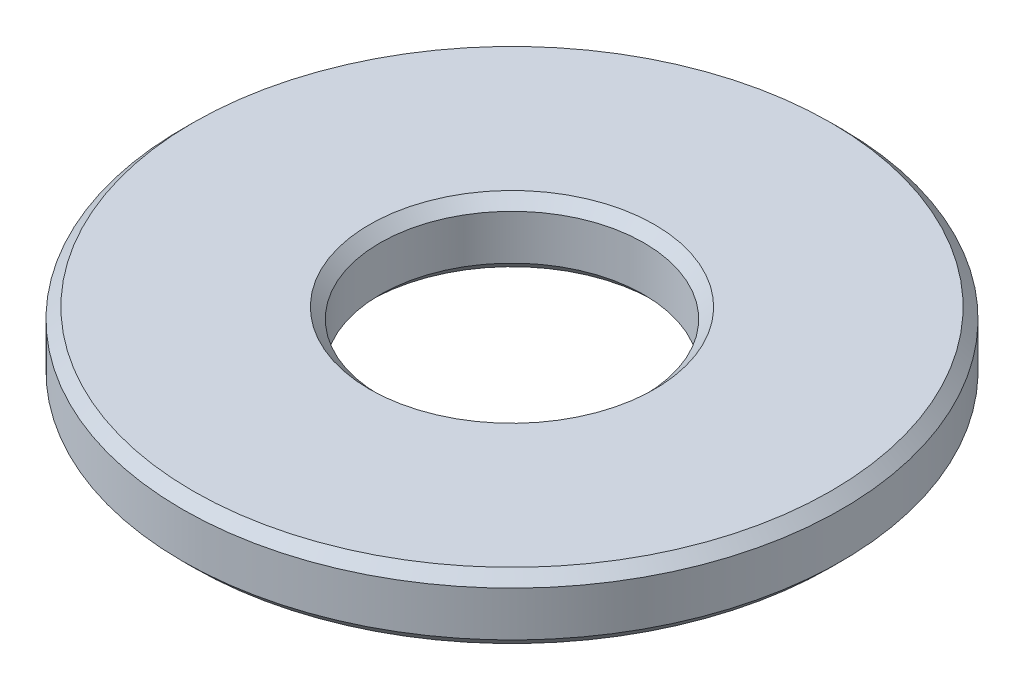
ISO-10303-21;
HEADER;
FILE_DESCRIPTION(('STEP AP214'),'2;1');
FILE_NAME('part.step','',(''),(''),'','','');
FILE_SCHEMA(('AUTOMOTIVE_DESIGN { 1 0 10303 214 1 1 1 1 }'));
ENDSEC;
DATA;
#1=APPLICATION_CONTEXT('core data for automotive mechanical design processes');
#2=APPLICATION_PROTOCOL_DEFINITION('international standard','automotive_design',2000,#1);
#3=PRODUCT_CONTEXT('',#1,'mechanical');
#4=PRODUCT('Part','Part','',(#3));
#5=PRODUCT_RELATED_PRODUCT_CATEGORY('part','',(#4));
#6=PRODUCT_DEFINITION_FORMATION('','',#4);
#7=PRODUCT_DEFINITION_CONTEXT('part definition',#1,'design');
#8=PRODUCT_DEFINITION('design','',#6,#7);
#9=PRODUCT_DEFINITION_SHAPE('','',#8);
#10=(LENGTH_UNIT() NAMED_UNIT(*) SI_UNIT(.MILLI.,.METRE.));
#11=(NAMED_UNIT(*) PLANE_ANGLE_UNIT() SI_UNIT($,.RADIAN.));
#12=(NAMED_UNIT(*) SI_UNIT($,.STERADIAN.) SOLID_ANGLE_UNIT());
#13=UNCERTAINTY_MEASURE_WITH_UNIT(LENGTH_MEASURE(1.E-05),#10,'distance_accuracy_value','');
#14=(GEOMETRIC_REPRESENTATION_CONTEXT(3) GLOBAL_UNCERTAINTY_ASSIGNED_CONTEXT((#13)) GLOBAL_UNIT_ASSIGNED_CONTEXT((#10,
#11,#12)) REPRESENTATION_CONTEXT('',''));
#15=CARTESIAN_POINT('',(0.,0.,0.));
#16=DIRECTION('',(0.,0.,1.));
#17=DIRECTION('',(1.,0.,0.));
#18=AXIS2_PLACEMENT_3D('',#15,#16,#17);
#19=CARTESIAN_POINT('',(3.9624,0.396875,0.));
#20=DIRECTION('',(0.,-1.,0.));
#21=DIRECTION('',(0.,0.,-1.));
#22=AXIS2_PLACEMENT_3D('',#19,#20,#21);
#23=PLANE('',#22);
#24=CARTESIAN_POINT('',(0.,0.396875,0.));
#25=DIRECTION('',(0.,-1.,0.));
#26=DIRECTION('',(0.,0.,-1.));
#27=AXIS2_PLACEMENT_3D('',#24,#25,#26);
#28=CIRCLE('',#27,3.8354);
#29=CARTESIAN_POINT('',(0.,0.396875,-3.8354));
#30=VERTEX_POINT('',#29);
#31=EDGE_CURVE('E41',#30,#30,#28,.F.);
#32=ORIENTED_EDGE('',*,*,#31,.T.);
#33=EDGE_LOOP('',(#32));
#34=FACE_BOUND('',#33,.T.);
#35=CARTESIAN_POINT('',(0.,0.396875,0.));
#36=DIRECTION('',(0.,-1.,0.));
#37=DIRECTION('',(0.,0.,-1.));
#38=AXIS2_PLACEMENT_3D('',#35,#36,#37);
#39=CIRCLE('',#38,1.7145);
#40=CARTESIAN_POINT('',(0.,0.396875,-1.7145));
#41=VERTEX_POINT('',#40);
#42=EDGE_CURVE('E45',#41,#41,#39,.T.);
#43=ORIENTED_EDGE('',*,*,#42,.T.);
#44=EDGE_LOOP('',(#43));
#45=FACE_BOUND('',#44,.T.);
#46=ADVANCED_FACE('F30',(#34,#45),#23,.F.);
#47=CARTESIAN_POINT('',(0.,3.4095890801261,0.));
#48=DIRECTION('',(0.,1.,0.));
#49=DIRECTION('',(0.,0.,1.));
#50=AXIS2_PLACEMENT_3D('',#47,#48,#49);
#51=CYLINDRICAL_SURFACE('',#50,1.5875);
#52=CARTESIAN_POINT('',(0.,0.269875,0.));
#53=DIRECTION('',(0.,-1.,0.));
#54=DIRECTION('',(0.,0.,-1.));
#55=AXIS2_PLACEMENT_3D('',#52,#53,#54);
#56=CIRCLE('',#55,1.5875);
#57=CARTESIAN_POINT('',(0.,0.269875,-1.5875));
#58=VERTEX_POINT('',#57);
#59=EDGE_CURVE('E10',#58,#58,#56,.F.);
#60=ORIENTED_EDGE('',*,*,#59,.T.);
#61=EDGE_LOOP('',(#60));
#62=FACE_BOUND('',#61,.T.);
#63=CARTESIAN_POINT('',(0.,-0.269874999999999,0.));
#64=DIRECTION('',(0.,1.,0.));
#65=DIRECTION('',(0.,0.,1.));
#66=AXIS2_PLACEMENT_3D('',#63,#64,#65);
#67=CIRCLE('',#66,1.5875);
#68=CARTESIAN_POINT('',(0.,-0.269874999999999,1.5875));
#69=VERTEX_POINT('',#68);
#70=EDGE_CURVE('E37',#69,#69,#67,.F.);
#71=ORIENTED_EDGE('',*,*,#70,.T.);
#72=EDGE_LOOP('',(#71));
#73=FACE_BOUND('',#72,.T.);
#74=ADVANCED_FACE('F75',(#62,#73),#51,.F.);
#75=CARTESIAN_POINT('',(1.5875,-0.396875,0.));
#76=DIRECTION('',(0.,1.,0.));
#77=DIRECTION('',(0.,0.,1.));
#78=AXIS2_PLACEMENT_3D('',#75,#76,#77);
#79=PLANE('',#78);
#80=CARTESIAN_POINT('',(0.,-0.396875,0.));
#81=DIRECTION('',(0.,1.,0.));
#82=DIRECTION('',(0.,0.,1.));
#83=AXIS2_PLACEMENT_3D('',#80,#81,#82);
#84=CIRCLE('',#83,3.8354);
#85=CARTESIAN_POINT('',(0.,-0.396875,3.8354));
#86=VERTEX_POINT('',#85);
#87=EDGE_CURVE('E50',#86,#86,#84,.F.);
#88=ORIENTED_EDGE('',*,*,#87,.T.);
#89=EDGE_LOOP('',(#88));
#90=FACE_BOUND('',#89,.T.);
#91=CARTESIAN_POINT('',(0.,-0.396875,0.));
#92=DIRECTION('',(0.,1.,0.));
#93=DIRECTION('',(0.,0.,1.));
#94=AXIS2_PLACEMENT_3D('',#91,#92,#93);
#95=CIRCLE('',#94,1.7145);
#96=CARTESIAN_POINT('',(0.,-0.396875,1.7145));
#97=VERTEX_POINT('',#96);
#98=EDGE_CURVE('E53',#97,#97,#95,.T.);
#99=ORIENTED_EDGE('',*,*,#98,.T.);
#100=EDGE_LOOP('',(#99));
#101=FACE_BOUND('',#100,.T.);
#102=ADVANCED_FACE('F91',(#90,#101),#79,.F.);
#103=CARTESIAN_POINT('',(0.,3.4095890801261,0.));
#104=DIRECTION('',(0.,1.,0.));
#105=DIRECTION('',(0.,0.,1.));
#106=AXIS2_PLACEMENT_3D('',#103,#104,#105);
#107=CYLINDRICAL_SURFACE('',#106,3.9624);
#108=CARTESIAN_POINT('',(0.,-0.269874999999999,0.));
#109=DIRECTION('',(0.,1.,0.));
#110=DIRECTION('',(0.,0.,1.));
#111=AXIS2_PLACEMENT_3D('',#108,#109,#110);
#112=CIRCLE('',#111,3.9624);
#113=CARTESIAN_POINT('',(0.,-0.269874999999999,3.9624));
#114=VERTEX_POINT('',#113);
#115=EDGE_CURVE('E56',#114,#114,#112,.T.);
#116=ORIENTED_EDGE('',*,*,#115,.T.);
#117=EDGE_LOOP('',(#116));
#118=FACE_BOUND('',#117,.T.);
#119=CARTESIAN_POINT('',(0.,0.269875000000001,0.));
#120=DIRECTION('',(0.,-1.,0.));
#121=DIRECTION('',(0.,0.,-1.));
#122=AXIS2_PLACEMENT_3D('',#119,#120,#121);
#123=CIRCLE('',#122,3.9624);
#124=CARTESIAN_POINT('',(0.,0.269875000000001,-3.9624));
#125=VERTEX_POINT('',#124);
#126=EDGE_CURVE('E59',#125,#125,#123,.T.);
#127=ORIENTED_EDGE('',*,*,#126,.T.);
#128=EDGE_LOOP('',(#127));
#129=FACE_BOUND('',#128,.T.);
#130=ADVANCED_FACE('F63',(#118,#129),#107,.T.);
#131=CARTESIAN_POINT('',(0.,-0.269874999999999,0.));
#132=DIRECTION('',(0.,1.,0.));
#133=DIRECTION('',(0.,0.,1.));
#134=AXIS2_PLACEMENT_3D('',#131,#132,#133);
#135=CONICAL_SURFACE('',#134,3.9624,0.785398163397448);
#136=ORIENTED_EDGE('',*,*,#87,.F.);
#137=EDGE_LOOP('',(#136));
#138=FACE_BOUND('',#137,.T.);
#139=ORIENTED_EDGE('',*,*,#115,.F.);
#140=EDGE_LOOP('',(#139));
#141=FACE_BOUND('',#140,.T.);
#142=ADVANCED_FACE('F69',(#138,#141),#135,.T.);
#143=CARTESIAN_POINT('',(0.,0.396875,0.));
#144=DIRECTION('',(0.,-1.,0.));
#145=DIRECTION('',(0.,0.,-1.));
#146=AXIS2_PLACEMENT_3D('',#143,#144,#145);
#147=CONICAL_SURFACE('',#146,3.8354,0.785398163397448);
#148=ORIENTED_EDGE('',*,*,#126,.F.);
#149=EDGE_LOOP('',(#148));
#150=FACE_BOUND('',#149,.T.);
#151=ORIENTED_EDGE('',*,*,#31,.F.);
#152=EDGE_LOOP('',(#151));
#153=FACE_BOUND('',#152,.T.);
#154=ADVANCED_FACE('F65',(#150,#153),#147,.T.);
#155=CARTESIAN_POINT('',(0.,0.269875,0.));
#156=DIRECTION('',(0.,1.,0.));
#157=DIRECTION('',(0.,0.,1.));
#158=AXIS2_PLACEMENT_3D('',#155,#156,#157);
#159=CONICAL_SURFACE('',#158,1.5875,0.785398163397452);
#160=ORIENTED_EDGE('',*,*,#42,.F.);
#161=EDGE_LOOP('',(#160));
#162=FACE_BOUND('',#161,.T.);
#163=ORIENTED_EDGE('',*,*,#59,.F.);
#164=EDGE_LOOP('',(#163));
#165=FACE_BOUND('',#164,.T.);
#166=ADVANCED_FACE('F68',(#162,#165),#159,.F.);
#167=CARTESIAN_POINT('',(0.,-0.396875,0.));
#168=DIRECTION('',(0.,-1.,0.));
#169=DIRECTION('',(0.,0.,-1.));
#170=AXIS2_PLACEMENT_3D('',#167,#168,#169);
#171=CONICAL_SURFACE('',#170,1.7145,0.785398163397444);
#172=ORIENTED_EDGE('',*,*,#70,.F.);
#173=EDGE_LOOP('',(#172));
#174=FACE_BOUND('',#173,.T.);
#175=ORIENTED_EDGE('',*,*,#98,.F.);
#176=EDGE_LOOP('',(#175));
#177=FACE_BOUND('',#176,.T.);
#178=ADVANCED_FACE('F32',(#174,#177),#171,.F.);
#179=CLOSED_SHELL('',(#46,#74,#102,#130,#142,#154,#166,#178));
#180=MANIFOLD_SOLID_BREP('B2',#179);
#181=ADVANCED_BREP_SHAPE_REPRESENTATION('',(#18,#180),#14);
#182=SHAPE_DEFINITION_REPRESENTATION(#9,#181);
ENDSEC;
END-ISO-10303-21;
